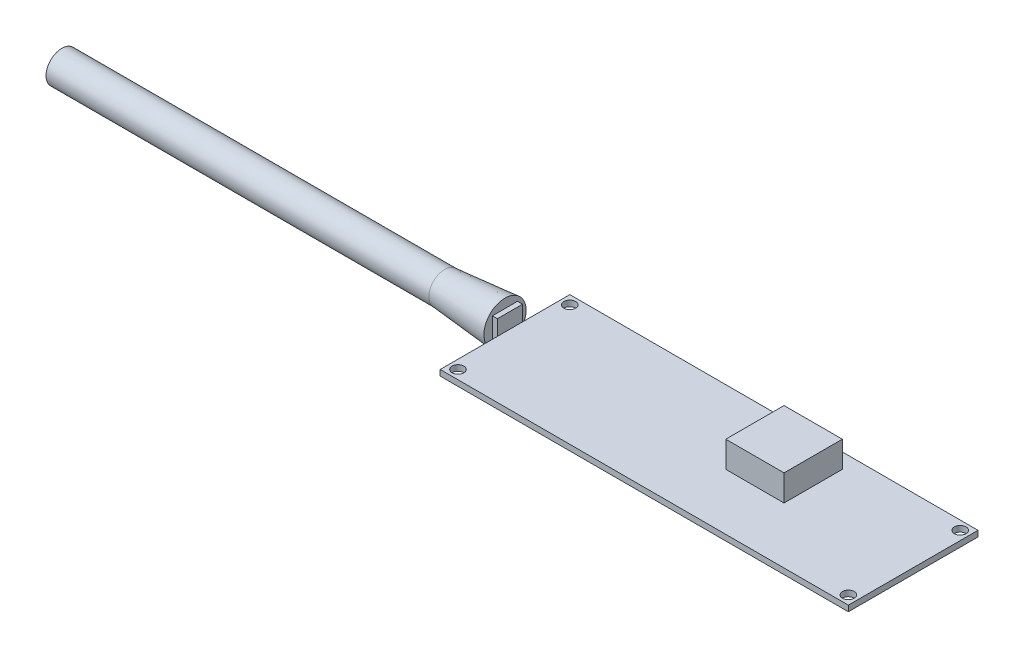
ISO-10303-21;
HEADER;
FILE_DESCRIPTION(('STEP AP214'),'2;1');
FILE_NAME('part.step','',(''),(''),'','','');
FILE_SCHEMA(('AUTOMOTIVE_DESIGN { 1 0 10303 214 1 1 1 1 }'));
ENDSEC;
DATA;
#1=APPLICATION_CONTEXT('core data for automotive mechanical design processes');
#2=APPLICATION_PROTOCOL_DEFINITION('international standard','automotive_design',2000,#1);
#3=PRODUCT_CONTEXT('',#1,'mechanical');
#4=PRODUCT('Part','Part','',(#3));
#5=PRODUCT_RELATED_PRODUCT_CATEGORY('part','',(#4));
#6=PRODUCT_DEFINITION_FORMATION('','',#4);
#7=PRODUCT_DEFINITION_CONTEXT('part definition',#1,'design');
#8=PRODUCT_DEFINITION('design','',#6,#7);
#9=PRODUCT_DEFINITION_SHAPE('','',#8);
#10=(LENGTH_UNIT() NAMED_UNIT(*) SI_UNIT(.MILLI.,.METRE.));
#11=(NAMED_UNIT(*) PLANE_ANGLE_UNIT() SI_UNIT($,.RADIAN.));
#12=(NAMED_UNIT(*) SI_UNIT($,.STERADIAN.) SOLID_ANGLE_UNIT());
#13=UNCERTAINTY_MEASURE_WITH_UNIT(LENGTH_MEASURE(1.E-05),#10,'distance_accuracy_value','');
#14=(GEOMETRIC_REPRESENTATION_CONTEXT(3) GLOBAL_UNCERTAINTY_ASSIGNED_CONTEXT((#13)) GLOBAL_UNIT_ASSIGNED_CONTEXT((#10,
#11,#12)) REPRESENTATION_CONTEXT('',''));
#15=CARTESIAN_POINT('',(0.,0.,0.));
#16=DIRECTION('',(0.,0.,1.));
#17=DIRECTION('',(1.,0.,0.));
#18=AXIS2_PLACEMENT_3D('',#15,#16,#17);
#19=CARTESIAN_POINT('',(-51.5874,1.4605,16.383));
#20=DIRECTION('',(1.,0.,0.));
#21=DIRECTION('',(0.,0.,-1.));
#22=AXIS2_PLACEMENT_3D('',#19,#20,#21);
#23=PLANE('',#22);
#24=DIRECTION('',(0.,1.,0.));
#25=VECTOR('',#24,1.);
#26=CARTESIAN_POINT('',(-51.5874,-0.762,1.905));
#27=LINE('',#26,#25);
#28=CARTESIAN_POINT('',(-51.5874,0.,1.905));
#29=VERTEX_POINT('',#28);
#30=CARTESIAN_POINT('',(-51.5874,1.4605,1.905));
#31=VERTEX_POINT('',#30);
#32=EDGE_CURVE('E11',#29,#31,#27,.T.);
#33=ORIENTED_EDGE('',*,*,#32,.F.);
#34=DIRECTION('',(0.,0.,1.));
#35=VECTOR('',#34,1.);
#36=CARTESIAN_POINT('',(-51.5874,0.,16.383));
#37=LINE('',#36,#35);
#38=CARTESIAN_POINT('',(-51.5874,0.,16.383));
#39=VERTEX_POINT('',#38);
#40=EDGE_CURVE('E260',#29,#39,#37,.T.);
#41=ORIENTED_EDGE('',*,*,#40,.T.);
#42=DIRECTION('',(0.,-1.,0.));
#43=VECTOR('',#42,1.);
#44=CARTESIAN_POINT('',(-51.5874,1.4605,16.383));
#45=LINE('',#44,#43);
#46=CARTESIAN_POINT('',(-51.5874,1.4605,16.383));
#47=VERTEX_POINT('',#46);
#48=EDGE_CURVE('E267',#47,#39,#45,.T.);
#49=ORIENTED_EDGE('',*,*,#48,.F.);
#50=DIRECTION('',(0.,0.,1.));
#51=VECTOR('',#50,1.);
#52=CARTESIAN_POINT('',(-51.5874,1.4605,16.383));
#53=LINE('',#52,#51);
#54=EDGE_CURVE('E57',#31,#47,#53,.T.);
#55=ORIENTED_EDGE('',*,*,#54,.F.);
#56=EDGE_LOOP('',(#33,#41,#49,#55));
#57=FACE_BOUND('',#56,.T.);
#58=ADVANCED_FACE('F36',(#57),#23,.F.);
#59=DIRECTION('',(0.,-1.,0.));
#60=VECTOR('',#59,1.);
#61=CARTESIAN_POINT('',(-51.5874,-0.762,-4.445));
#62=LINE('',#61,#60);
#63=CARTESIAN_POINT('',(-51.5874,1.4605,-4.445));
#64=VERTEX_POINT('',#63);
#65=CARTESIAN_POINT('',(-51.5874,0.,-4.445));
#66=VERTEX_POINT('',#65);
#67=EDGE_CURVE('E47',#64,#66,#62,.T.);
#68=ORIENTED_EDGE('',*,*,#67,.F.);
#69=CARTESIAN_POINT('',(-51.5874,1.4605,-16.383));
#70=VERTEX_POINT('',#69);
#71=EDGE_CURVE('E250',#70,#64,#53,.T.);
#72=ORIENTED_EDGE('',*,*,#71,.F.);
#73=DIRECTION('',(0.,-1.,0.));
#74=VECTOR('',#73,1.);
#75=CARTESIAN_POINT('',(-51.5874,1.4605,-16.383));
#76=LINE('',#75,#74);
#77=CARTESIAN_POINT('',(-51.5874,0.,-16.383));
#78=VERTEX_POINT('',#77);
#79=EDGE_CURVE('E270',#70,#78,#76,.T.);
#80=ORIENTED_EDGE('',*,*,#79,.T.);
#81=EDGE_CURVE('E261',#78,#66,#37,.T.);
#82=ORIENTED_EDGE('',*,*,#81,.T.);
#83=EDGE_LOOP('',(#68,#72,#80,#82));
#84=FACE_BOUND('',#83,.T.);
#85=ADVANCED_FACE('F340',(#84),#23,.F.);
#86=CARTESIAN_POINT('',(0.,1.4605,0.));
#87=DIRECTION('',(0.,-1.,0.));
#88=DIRECTION('',(0.,0.,-1.));
#89=AXIS2_PLACEMENT_3D('',#86,#87,#88);
#90=PLANE('',#89);
#91=DIRECTION('',(0.,0.,-1.));
#92=VECTOR('',#91,1.);
#93=CARTESIAN_POINT('',(51.5874,1.4605,16.383));
#94=LINE('',#93,#92);
#95=CARTESIAN_POINT('',(51.5874,1.4605,16.383));
#96=VERTEX_POINT('',#95);
#97=CARTESIAN_POINT('',(51.5874,1.4605,-16.383));
#98=VERTEX_POINT('',#97);
#99=EDGE_CURVE('E244',#96,#98,#94,.T.);
#100=ORIENTED_EDGE('',*,*,#99,.T.);
#101=DIRECTION('',(-1.,0.,0.));
#102=VECTOR('',#101,1.);
#103=CARTESIAN_POINT('',(-51.5874,1.4605,-16.383));
#104=LINE('',#103,#102);
#105=EDGE_CURVE('E247',#98,#70,#104,.T.);
#106=ORIENTED_EDGE('',*,*,#105,.T.);
#107=ORIENTED_EDGE('',*,*,#71,.T.);
#108=EDGE_CURVE('E253',#64,#31,#53,.T.);
#109=ORIENTED_EDGE('',*,*,#108,.T.);
#110=ORIENTED_EDGE('',*,*,#54,.T.);
#111=DIRECTION('',(1.,0.,0.));
#112=VECTOR('',#111,1.);
#113=CARTESIAN_POINT('',(-51.5874,1.4605,16.383));
#114=LINE('',#113,#112);
#115=EDGE_CURVE('E252',#47,#96,#114,.T.);
#116=ORIENTED_EDGE('',*,*,#115,.T.);
#117=EDGE_LOOP('',(#100,#106,#107,#109,#110,#116));
#118=FACE_BOUND('',#117,.T.);
#119=CARTESIAN_POINT('',(-49.3395,1.4605,-14.1351));
#120=DIRECTION('',(0.,1.,0.));
#121=DIRECTION('',(0.,0.,1.));
#122=AXIS2_PLACEMENT_3D('',#119,#120,#121);
#123=CIRCLE('',#122,1.4859);
#124=CARTESIAN_POINT('',(-49.3395,1.4605,-12.6492));
#125=VERTEX_POINT('',#124);
#126=EDGE_CURVE('E227',#125,#125,#123,.T.);
#127=ORIENTED_EDGE('',*,*,#126,.F.);
#128=EDGE_LOOP('',(#127));
#129=FACE_BOUND('',#128,.T.);
#130=CARTESIAN_POINT('',(49.3395,1.4605,-14.1351));
#131=DIRECTION('',(0.,1.,0.));
#132=DIRECTION('',(0.,0.,1.));
#133=AXIS2_PLACEMENT_3D('',#130,#131,#132);
#134=CIRCLE('',#133,1.4859);
#135=CARTESIAN_POINT('',(49.3395,1.4605,-12.6492));
#136=VERTEX_POINT('',#135);
#137=EDGE_CURVE('E220',#136,#136,#134,.T.);
#138=ORIENTED_EDGE('',*,*,#137,.F.);
#139=EDGE_LOOP('',(#138));
#140=FACE_BOUND('',#139,.T.);
#141=CARTESIAN_POINT('',(49.3395,1.4605,14.1351));
#142=DIRECTION('',(0.,1.,0.));
#143=DIRECTION('',(0.,0.,1.));
#144=AXIS2_PLACEMENT_3D('',#141,#142,#143);
#145=CIRCLE('',#144,1.4859);
#146=CARTESIAN_POINT('',(49.3395,1.4605,15.621));
#147=VERTEX_POINT('',#146);
#148=EDGE_CURVE('E228',#147,#147,#145,.T.);
#149=ORIENTED_EDGE('',*,*,#148,.F.);
#150=EDGE_LOOP('',(#149));
#151=FACE_BOUND('',#150,.T.);
#152=CARTESIAN_POINT('',(-49.3395,1.4605,14.1351));
#153=DIRECTION('',(0.,1.,0.));
#154=DIRECTION('',(0.,0.,1.));
#155=AXIS2_PLACEMENT_3D('',#152,#153,#154);
#156=CIRCLE('',#155,1.4859);
#157=CARTESIAN_POINT('',(-49.3395,1.4605,15.621));
#158=VERTEX_POINT('',#157);
#159=EDGE_CURVE('E219',#158,#158,#156,.T.);
#160=ORIENTED_EDGE('',*,*,#159,.F.);
#161=EDGE_LOOP('',(#160));
#162=FACE_BOUND('',#161,.T.);
#163=DIRECTION('',(0.,0.,-1.));
#164=VECTOR('',#163,1.);
#165=CARTESIAN_POINT('',(21.1074,1.4605,-12.573));
#166=LINE('',#165,#164);
#167=CARTESIAN_POINT('',(21.1074,1.4605,2.159));
#168=VERTEX_POINT('',#167);
#169=CARTESIAN_POINT('',(21.1074,1.4605,-12.573));
#170=VERTEX_POINT('',#169);
#171=EDGE_CURVE('E186',#168,#170,#166,.T.);
#172=ORIENTED_EDGE('',*,*,#171,.F.);
#173=DIRECTION('',(1.,0.,0.));
#174=VECTOR('',#173,1.);
#175=CARTESIAN_POINT('',(6.37540000000003,1.4605,2.159));
#176=LINE('',#175,#174);
#177=CARTESIAN_POINT('',(6.37540000000003,1.4605,2.159));
#178=VERTEX_POINT('',#177);
#179=EDGE_CURVE('E191',#178,#168,#176,.T.);
#180=ORIENTED_EDGE('',*,*,#179,.F.);
#181=DIRECTION('',(0.,0.,1.));
#182=VECTOR('',#181,1.);
#183=CARTESIAN_POINT('',(6.37540000000002,1.4605,-12.573));
#184=LINE('',#183,#182);
#185=CARTESIAN_POINT('',(6.37540000000002,1.4605,-12.573));
#186=VERTEX_POINT('',#185);
#187=EDGE_CURVE('E203',#186,#178,#184,.T.);
#188=ORIENTED_EDGE('',*,*,#187,.F.);
#189=DIRECTION('',(-1.,0.,0.));
#190=VECTOR('',#189,1.);
#191=CARTESIAN_POINT('',(6.37540000000002,1.4605,-12.573));
#192=LINE('',#191,#190);
#193=EDGE_CURVE('E200',#170,#186,#192,.T.);
#194=ORIENTED_EDGE('',*,*,#193,.F.);
#195=EDGE_LOOP('',(#172,#180,#188,#194));
#196=FACE_BOUND('',#195,.T.);
#197=ADVANCED_FACE('F320',(#118,#129,#140,#151,#162,#196),#90,.F.);
#198=CARTESIAN_POINT('',(51.5874,1.4605,16.383));
#199=DIRECTION('',(-1.,0.,0.));
#200=DIRECTION('',(0.,0.,1.));
#201=AXIS2_PLACEMENT_3D('',#198,#199,#200);
#202=PLANE('',#201);
#203=DIRECTION('',(0.,0.,-1.));
#204=VECTOR('',#203,1.);
#205=CARTESIAN_POINT('',(51.5874,0.,16.383));
#206=LINE('',#205,#204);
#207=CARTESIAN_POINT('',(51.5874,0.,16.383));
#208=VERTEX_POINT('',#207);
#209=CARTESIAN_POINT('',(51.5874,0.,-16.383));
#210=VERTEX_POINT('',#209);
#211=EDGE_CURVE('E243',#208,#210,#206,.T.);
#212=ORIENTED_EDGE('',*,*,#211,.T.);
#213=DIRECTION('',(0.,-1.,0.));
#214=VECTOR('',#213,1.);
#215=CARTESIAN_POINT('',(51.5874,1.4605,-16.383));
#216=LINE('',#215,#214);
#217=EDGE_CURVE('E273',#98,#210,#216,.T.);
#218=ORIENTED_EDGE('',*,*,#217,.F.);
#219=ORIENTED_EDGE('',*,*,#99,.F.);
#220=DIRECTION('',(0.,-1.,0.));
#221=VECTOR('',#220,1.);
#222=CARTESIAN_POINT('',(51.5874,1.4605,16.383));
#223=LINE('',#222,#221);
#224=EDGE_CURVE('E255',#96,#208,#223,.T.);
#225=ORIENTED_EDGE('',*,*,#224,.T.);
#226=EDGE_LOOP('',(#212,#218,#219,#225));
#227=FACE_BOUND('',#226,.T.);
#228=ADVANCED_FACE('F38',(#227),#202,.F.);
#229=CARTESIAN_POINT('',(-51.5874,1.4605,-16.383));
#230=DIRECTION('',(0.,0.,1.));
#231=DIRECTION('',(1.,0.,0.));
#232=AXIS2_PLACEMENT_3D('',#229,#230,#231);
#233=PLANE('',#232);
#234=DIRECTION('',(-1.,0.,0.));
#235=VECTOR('',#234,1.);
#236=CARTESIAN_POINT('',(-51.5874,0.,-16.383));
#237=LINE('',#236,#235);
#238=EDGE_CURVE('E258',#210,#78,#237,.T.);
#239=ORIENTED_EDGE('',*,*,#238,.T.);
#240=ORIENTED_EDGE('',*,*,#79,.F.);
#241=ORIENTED_EDGE('',*,*,#105,.F.);
#242=ORIENTED_EDGE('',*,*,#217,.T.);
#243=EDGE_LOOP('',(#239,#240,#241,#242));
#244=FACE_BOUND('',#243,.T.);
#245=ADVANCED_FACE('F347',(#244),#233,.F.);
#246=CARTESIAN_POINT('',(-51.5874,1.4605,16.383));
#247=DIRECTION('',(0.,0.,-1.));
#248=DIRECTION('',(-1.,0.,0.));
#249=AXIS2_PLACEMENT_3D('',#246,#247,#248);
#250=PLANE('',#249);
#251=DIRECTION('',(1.,0.,0.));
#252=VECTOR('',#251,1.);
#253=CARTESIAN_POINT('',(-51.5874,0.,16.383));
#254=LINE('',#253,#252);
#255=EDGE_CURVE('E248',#39,#208,#254,.T.);
#256=ORIENTED_EDGE('',*,*,#255,.T.);
#257=ORIENTED_EDGE('',*,*,#224,.F.);
#258=ORIENTED_EDGE('',*,*,#115,.F.);
#259=ORIENTED_EDGE('',*,*,#48,.T.);
#260=EDGE_LOOP('',(#256,#257,#258,#259));
#261=FACE_BOUND('',#260,.T.);
#262=ADVANCED_FACE('F314',(#261),#250,.F.);
#263=CARTESIAN_POINT('',(0.,0.,0.));
#264=DIRECTION('',(0.,-1.,0.));
#265=DIRECTION('',(0.,0.,-1.));
#266=AXIS2_PLACEMENT_3D('',#263,#264,#265);
#267=PLANE('',#266);
#268=CARTESIAN_POINT('',(-49.3395,0.,14.1351));
#269=DIRECTION('',(0.,-1.,0.));
#270=DIRECTION('',(0.,0.,-1.));
#271=AXIS2_PLACEMENT_3D('',#268,#269,#270);
#272=CIRCLE('',#271,1.4859);
#273=CARTESIAN_POINT('',(-49.3395,0.,12.6492));
#274=VERTEX_POINT('',#273);
#275=EDGE_CURVE('E231',#274,#274,#272,.F.);
#276=ORIENTED_EDGE('',*,*,#275,.T.);
#277=EDGE_LOOP('',(#276));
#278=FACE_BOUND('',#277,.T.);
#279=CARTESIAN_POINT('',(49.3395,0.,14.1351));
#280=DIRECTION('',(0.,-1.,0.));
#281=DIRECTION('',(0.,0.,-1.));
#282=AXIS2_PLACEMENT_3D('',#279,#280,#281);
#283=CIRCLE('',#282,1.4859);
#284=CARTESIAN_POINT('',(49.3395,0.,12.6492));
#285=VERTEX_POINT('',#284);
#286=EDGE_CURVE('E224',#285,#285,#283,.F.);
#287=ORIENTED_EDGE('',*,*,#286,.T.);
#288=EDGE_LOOP('',(#287));
#289=FACE_BOUND('',#288,.T.);
#290=CARTESIAN_POINT('',(49.3395,0.,-14.1351));
#291=DIRECTION('',(0.,-1.,0.));
#292=DIRECTION('',(0.,0.,-1.));
#293=AXIS2_PLACEMENT_3D('',#290,#291,#292);
#294=CIRCLE('',#293,1.4859);
#295=CARTESIAN_POINT('',(49.3395,0.,-15.621));
#296=VERTEX_POINT('',#295);
#297=EDGE_CURVE('E223',#296,#296,#294,.F.);
#298=ORIENTED_EDGE('',*,*,#297,.T.);
#299=EDGE_LOOP('',(#298));
#300=FACE_BOUND('',#299,.T.);
#301=CARTESIAN_POINT('',(-49.3395,0.,-14.1351));
#302=DIRECTION('',(0.,-1.,0.));
#303=DIRECTION('',(0.,0.,-1.));
#304=AXIS2_PLACEMENT_3D('',#301,#302,#303);
#305=CIRCLE('',#304,1.4859);
#306=CARTESIAN_POINT('',(-49.3395,0.,-15.621));
#307=VERTEX_POINT('',#306);
#308=EDGE_CURVE('E240',#307,#307,#305,.F.);
#309=ORIENTED_EDGE('',*,*,#308,.T.);
#310=EDGE_LOOP('',(#309));
#311=FACE_BOUND('',#310,.T.);
#312=ORIENTED_EDGE('',*,*,#211,.F.);
#313=ORIENTED_EDGE('',*,*,#255,.F.);
#314=ORIENTED_EDGE('',*,*,#40,.F.);
#315=EDGE_CURVE('E263',#66,#29,#37,.T.);
#316=ORIENTED_EDGE('',*,*,#315,.F.);
#317=ORIENTED_EDGE('',*,*,#81,.F.);
#318=ORIENTED_EDGE('',*,*,#238,.F.);
#319=EDGE_LOOP('',(#312,#313,#314,#316,#317,#318));
#320=FACE_BOUND('',#319,.T.);
#321=ADVANCED_FACE('F310',(#278,#289,#300,#311,#320),#267,.T.);
#322=CARTESIAN_POINT('',(-49.3395,-4.20275986466036,-14.1351));
#323=DIRECTION('',(0.,1.,0.));
#324=DIRECTION('',(0.,0.,1.));
#325=AXIS2_PLACEMENT_3D('',#322,#323,#324);
#326=CYLINDRICAL_SURFACE('',#325,1.4859);
#327=ORIENTED_EDGE('',*,*,#126,.T.);
#328=EDGE_LOOP('',(#327));
#329=FACE_BOUND('',#328,.T.);
#330=ORIENTED_EDGE('',*,*,#308,.F.);
#331=EDGE_LOOP('',(#330));
#332=FACE_BOUND('',#331,.T.);
#333=ADVANCED_FACE('F361',(#329,#332),#326,.F.);
#334=CARTESIAN_POINT('',(49.3395,-4.20275986466036,-14.1351));
#335=DIRECTION('',(0.,1.,0.));
#336=DIRECTION('',(0.,0.,1.));
#337=AXIS2_PLACEMENT_3D('',#334,#335,#336);
#338=CYLINDRICAL_SURFACE('',#337,1.4859);
#339=ORIENTED_EDGE('',*,*,#137,.T.);
#340=EDGE_LOOP('',(#339));
#341=FACE_BOUND('',#340,.T.);
#342=ORIENTED_EDGE('',*,*,#297,.F.);
#343=EDGE_LOOP('',(#342));
#344=FACE_BOUND('',#343,.T.);
#345=ADVANCED_FACE('F368',(#341,#344),#338,.F.);
#346=CARTESIAN_POINT('',(49.3395,-4.20275986466036,14.1351));
#347=DIRECTION('',(0.,1.,0.));
#348=DIRECTION('',(0.,0.,1.));
#349=AXIS2_PLACEMENT_3D('',#346,#347,#348);
#350=CYLINDRICAL_SURFACE('',#349,1.4859);
#351=ORIENTED_EDGE('',*,*,#148,.T.);
#352=EDGE_LOOP('',(#351));
#353=FACE_BOUND('',#352,.T.);
#354=ORIENTED_EDGE('',*,*,#286,.F.);
#355=EDGE_LOOP('',(#354));
#356=FACE_BOUND('',#355,.T.);
#357=ADVANCED_FACE('F380',(#353,#356),#350,.F.);
#358=CARTESIAN_POINT('',(-49.3395,-4.20275986466036,14.1351));
#359=DIRECTION('',(0.,1.,0.));
#360=DIRECTION('',(0.,0.,1.));
#361=AXIS2_PLACEMENT_3D('',#358,#359,#360);
#362=CYLINDRICAL_SURFACE('',#361,1.4859);
#363=ORIENTED_EDGE('',*,*,#159,.T.);
#364=EDGE_LOOP('',(#363));
#365=FACE_BOUND('',#364,.T.);
#366=ORIENTED_EDGE('',*,*,#275,.F.);
#367=EDGE_LOOP('',(#366));
#368=FACE_BOUND('',#367,.T.);
#369=ADVANCED_FACE('F386',(#365,#368),#362,.F.);
#370=CARTESIAN_POINT('',(21.1074,8.0645,-12.573));
#371=DIRECTION('',(-1.,0.,0.));
#372=DIRECTION('',(0.,0.,1.));
#373=AXIS2_PLACEMENT_3D('',#370,#371,#372);
#374=PLANE('',#373);
#375=ORIENTED_EDGE('',*,*,#171,.T.);
#376=DIRECTION('',(0.,-1.,0.));
#377=VECTOR('',#376,1.);
#378=CARTESIAN_POINT('',(21.1074,8.0645,-12.573));
#379=LINE('',#378,#377);
#380=CARTESIAN_POINT('',(21.1074,8.0645,-12.573));
#381=VERTEX_POINT('',#380);
#382=EDGE_CURVE('E216',#381,#170,#379,.T.);
#383=ORIENTED_EDGE('',*,*,#382,.F.);
#384=DIRECTION('',(0.,0.,-1.));
#385=VECTOR('',#384,1.);
#386=CARTESIAN_POINT('',(21.1074,8.0645,-12.573));
#387=LINE('',#386,#385);
#388=CARTESIAN_POINT('',(21.1074,8.0645,2.159));
#389=VERTEX_POINT('',#388);
#390=EDGE_CURVE('E187',#389,#381,#387,.T.);
#391=ORIENTED_EDGE('',*,*,#390,.F.);
#392=DIRECTION('',(0.,-1.,0.));
#393=VECTOR('',#392,1.);
#394=CARTESIAN_POINT('',(21.1074,8.0645,2.159));
#395=LINE('',#394,#393);
#396=EDGE_CURVE('E197',#389,#168,#395,.T.);
#397=ORIENTED_EDGE('',*,*,#396,.T.);
#398=EDGE_LOOP('',(#375,#383,#391,#397));
#399=FACE_BOUND('',#398,.T.);
#400=ADVANCED_FACE('F390',(#399),#374,.F.);
#401=CARTESIAN_POINT('',(6.37540000000002,8.0645,-12.573));
#402=DIRECTION('',(0.,0.,1.));
#403=DIRECTION('',(1.,0.,0.));
#404=AXIS2_PLACEMENT_3D('',#401,#402,#403);
#405=PLANE('',#404);
#406=ORIENTED_EDGE('',*,*,#193,.T.);
#407=DIRECTION('',(0.,-1.,0.));
#408=VECTOR('',#407,1.);
#409=CARTESIAN_POINT('',(6.37540000000002,8.0645,-12.573));
#410=LINE('',#409,#408);
#411=CARTESIAN_POINT('',(6.37540000000002,8.0645,-12.573));
#412=VERTEX_POINT('',#411);
#413=EDGE_CURVE('E213',#412,#186,#410,.T.);
#414=ORIENTED_EDGE('',*,*,#413,.F.);
#415=DIRECTION('',(-1.,0.,0.));
#416=VECTOR('',#415,1.);
#417=CARTESIAN_POINT('',(6.37540000000002,8.0645,-12.573));
#418=LINE('',#417,#416);
#419=EDGE_CURVE('E190',#381,#412,#418,.T.);
#420=ORIENTED_EDGE('',*,*,#419,.F.);
#421=ORIENTED_EDGE('',*,*,#382,.T.);
#422=EDGE_LOOP('',(#406,#414,#420,#421));
#423=FACE_BOUND('',#422,.T.);
#424=ADVANCED_FACE('F397',(#423),#405,.F.);
#425=CARTESIAN_POINT('',(6.37540000000002,8.0645,-12.573));
#426=DIRECTION('',(1.,0.,0.));
#427=DIRECTION('',(0.,0.,-1.));
#428=AXIS2_PLACEMENT_3D('',#425,#426,#427);
#429=PLANE('',#428);
#430=ORIENTED_EDGE('',*,*,#187,.T.);
#431=DIRECTION('',(0.,-1.,0.));
#432=VECTOR('',#431,1.);
#433=CARTESIAN_POINT('',(6.37540000000003,8.0645,2.159));
#434=LINE('',#433,#432);
#435=CARTESIAN_POINT('',(6.37540000000003,8.0645,2.159));
#436=VERTEX_POINT('',#435);
#437=EDGE_CURVE('E210',#436,#178,#434,.T.);
#438=ORIENTED_EDGE('',*,*,#437,.F.);
#439=DIRECTION('',(0.,0.,1.));
#440=VECTOR('',#439,1.);
#441=CARTESIAN_POINT('',(6.37540000000002,8.0645,-12.573));
#442=LINE('',#441,#440);
#443=EDGE_CURVE('E193',#412,#436,#442,.T.);
#444=ORIENTED_EDGE('',*,*,#443,.F.);
#445=ORIENTED_EDGE('',*,*,#413,.T.);
#446=EDGE_LOOP('',(#430,#438,#444,#445));
#447=FACE_BOUND('',#446,.T.);
#448=ADVANCED_FACE('F412',(#447),#429,.F.);
#449=CARTESIAN_POINT('',(6.37540000000003,8.0645,2.159));
#450=DIRECTION('',(0.,0.,-1.));
#451=DIRECTION('',(-1.,0.,0.));
#452=AXIS2_PLACEMENT_3D('',#449,#450,#451);
#453=PLANE('',#452);
#454=ORIENTED_EDGE('',*,*,#179,.T.);
#455=ORIENTED_EDGE('',*,*,#396,.F.);
#456=DIRECTION('',(1.,0.,0.));
#457=VECTOR('',#456,1.);
#458=CARTESIAN_POINT('',(6.37540000000003,8.0645,2.159));
#459=LINE('',#458,#457);
#460=EDGE_CURVE('E195',#436,#389,#459,.T.);
#461=ORIENTED_EDGE('',*,*,#460,.F.);
#462=ORIENTED_EDGE('',*,*,#437,.T.);
#463=EDGE_LOOP('',(#454,#455,#461,#462));
#464=FACE_BOUND('',#463,.T.);
#465=ADVANCED_FACE('F334',(#464),#453,.F.);
#466=CARTESIAN_POINT('',(0.,8.0645,0.));
#467=DIRECTION('',(0.,1.,0.));
#468=DIRECTION('',(0.,0.,1.));
#469=AXIS2_PLACEMENT_3D('',#466,#467,#468);
#470=PLANE('',#469);
#471=ORIENTED_EDGE('',*,*,#390,.T.);
#472=ORIENTED_EDGE('',*,*,#419,.T.);
#473=ORIENTED_EDGE('',*,*,#443,.T.);
#474=ORIENTED_EDGE('',*,*,#460,.T.);
#475=EDGE_LOOP('',(#471,#472,#473,#474));
#476=FACE_BOUND('',#475,.T.);
#477=ADVANCED_FACE('F327',(#476),#470,.T.);
#478=CARTESIAN_POINT('',(-51.5874,0.,0.));
#479=DIRECTION('',(1.,0.,0.));
#480=DIRECTION('',(0.,0.,-1.));
#481=AXIS2_PLACEMENT_3D('',#478,#479,#480);
#482=PLANE('',#481);
#483=ORIENTED_EDGE('',*,*,#108,.F.);
#484=CARTESIAN_POINT('',(-51.5874,5.334,-4.445));
#485=VERTEX_POINT('',#484);
#486=EDGE_CURVE('E177',#485,#64,#62,.T.);
#487=ORIENTED_EDGE('',*,*,#486,.F.);
#488=DIRECTION('',(0.,0.,-1.));
#489=VECTOR('',#488,1.);
#490=CARTESIAN_POINT('',(-51.5874,5.334,-4.445));
#491=LINE('',#490,#489);
#492=CARTESIAN_POINT('',(-51.5874,5.334,1.905));
#493=VERTEX_POINT('',#492);
#494=EDGE_CURVE('E174',#493,#485,#491,.T.);
#495=ORIENTED_EDGE('',*,*,#494,.F.);
#496=EDGE_CURVE('E50',#31,#493,#27,.T.);
#497=ORIENTED_EDGE('',*,*,#496,.F.);
#498=EDGE_LOOP('',(#483,#487,#495,#497));
#499=FACE_BOUND('',#498,.T.);
#500=ADVANCED_FACE('F325',(#499),#482,.T.);
#501=CARTESIAN_POINT('',(-52.8574,-0.762,1.905));
#502=DIRECTION('',(0.,0.,-1.));
#503=DIRECTION('',(-1.,0.,0.));
#504=AXIS2_PLACEMENT_3D('',#501,#502,#503);
#505=PLANE('',#504);
#506=CARTESIAN_POINT('',(-51.5874,-0.762,1.905));
#507=VERTEX_POINT('',#506);
#508=EDGE_CURVE('E49',#507,#29,#27,.T.);
#509=ORIENTED_EDGE('',*,*,#508,.T.);
#510=ORIENTED_EDGE('',*,*,#32,.T.);
#511=ORIENTED_EDGE('',*,*,#496,.T.);
#512=DIRECTION('',(1.,0.,0.));
#513=VECTOR('',#512,1.);
#514=CARTESIAN_POINT('',(-52.8574,5.334,1.905));
#515=LINE('',#514,#513);
#516=CARTESIAN_POINT('',(-52.8574,5.334,1.905));
#517=VERTEX_POINT('',#516);
#518=EDGE_CURVE('E151',#517,#493,#515,.T.);
#519=ORIENTED_EDGE('',*,*,#518,.F.);
#520=DIRECTION('',(0.,1.,0.));
#521=VECTOR('',#520,1.);
#522=CARTESIAN_POINT('',(-52.8574,-0.762,1.905));
#523=LINE('',#522,#521);
#524=CARTESIAN_POINT('',(-52.8574,-0.762,1.905));
#525=VERTEX_POINT('',#524);
#526=EDGE_CURVE('E144',#525,#517,#523,.T.);
#527=ORIENTED_EDGE('',*,*,#526,.F.);
#528=DIRECTION('',(1.,0.,0.));
#529=VECTOR('',#528,1.);
#530=CARTESIAN_POINT('',(-52.8574,-0.762,1.905));
#531=LINE('',#530,#529);
#532=EDGE_CURVE('E148',#525,#507,#531,.T.);
#533=ORIENTED_EDGE('',*,*,#532,.T.);
#534=EDGE_LOOP('',(#509,#510,#511,#519,#527,#533));
#535=FACE_BOUND('',#534,.T.);
#536=ADVANCED_FACE('F147',(#535),#505,.F.);
#537=CARTESIAN_POINT('',(-52.8574,5.334,-4.445));
#538=DIRECTION('',(0.,-1.,0.));
#539=DIRECTION('',(0.,0.,-1.));
#540=AXIS2_PLACEMENT_3D('',#537,#538,#539);
#541=PLANE('',#540);
#542=ORIENTED_EDGE('',*,*,#494,.T.);
#543=DIRECTION('',(1.,0.,0.));
#544=VECTOR('',#543,1.);
#545=CARTESIAN_POINT('',(-52.8574,5.334,-4.445));
#546=LINE('',#545,#544);
#547=CARTESIAN_POINT('',(-52.8574,5.334,-4.445));
#548=VERTEX_POINT('',#547);
#549=EDGE_CURVE('E182',#548,#485,#546,.T.);
#550=ORIENTED_EDGE('',*,*,#549,.F.);
#551=DIRECTION('',(0.,0.,-1.));
#552=VECTOR('',#551,1.);
#553=CARTESIAN_POINT('',(-52.8574,5.334,-4.445));
#554=LINE('',#553,#552);
#555=EDGE_CURVE('E155',#517,#548,#554,.T.);
#556=ORIENTED_EDGE('',*,*,#555,.F.);
#557=ORIENTED_EDGE('',*,*,#518,.T.);
#558=EDGE_LOOP('',(#542,#550,#556,#557));
#559=FACE_BOUND('',#558,.T.);
#560=ADVANCED_FACE('F295',(#559),#541,.F.);
#561=CARTESIAN_POINT('',(-52.8574,-0.762,-4.445));
#562=DIRECTION('',(0.,0.,1.));
#563=DIRECTION('',(1.,0.,0.));
#564=AXIS2_PLACEMENT_3D('',#561,#562,#563);
#565=PLANE('',#564);
#566=ORIENTED_EDGE('',*,*,#486,.T.);
#567=ORIENTED_EDGE('',*,*,#67,.T.);
#568=CARTESIAN_POINT('',(-51.5874,-0.762,-4.445));
#569=VERTEX_POINT('',#568);
#570=EDGE_CURVE('E176',#66,#569,#62,.T.);
#571=ORIENTED_EDGE('',*,*,#570,.T.);
#572=DIRECTION('',(1.,0.,0.));
#573=VECTOR('',#572,1.);
#574=CARTESIAN_POINT('',(-52.8574,-0.762,-4.445));
#575=LINE('',#574,#573);
#576=CARTESIAN_POINT('',(-52.8574,-0.762,-4.445));
#577=VERTEX_POINT('',#576);
#578=EDGE_CURVE('E165',#577,#569,#575,.T.);
#579=ORIENTED_EDGE('',*,*,#578,.F.);
#580=DIRECTION('',(0.,-1.,0.));
#581=VECTOR('',#580,1.);
#582=CARTESIAN_POINT('',(-52.8574,-0.762,-4.445));
#583=LINE('',#582,#581);
#584=EDGE_CURVE('E169',#548,#577,#583,.T.);
#585=ORIENTED_EDGE('',*,*,#584,.F.);
#586=ORIENTED_EDGE('',*,*,#549,.T.);
#587=EDGE_LOOP('',(#566,#567,#571,#579,#585,#586));
#588=FACE_BOUND('',#587,.T.);
#589=ADVANCED_FACE('F299',(#588),#565,.F.);
#590=CARTESIAN_POINT('',(-52.8574,-0.762,-4.445));
#591=DIRECTION('',(0.,1.,0.));
#592=DIRECTION('',(0.,0.,1.));
#593=AXIS2_PLACEMENT_3D('',#590,#591,#592);
#594=PLANE('',#593);
#595=DIRECTION('',(0.,0.,1.));
#596=VECTOR('',#595,1.);
#597=CARTESIAN_POINT('',(-51.5874,-0.762,-4.445));
#598=LINE('',#597,#596);
#599=EDGE_CURVE('E156',#569,#507,#598,.T.);
#600=ORIENTED_EDGE('',*,*,#599,.T.);
#601=ORIENTED_EDGE('',*,*,#532,.F.);
#602=DIRECTION('',(0.,0.,1.));
#603=VECTOR('',#602,1.);
#604=CARTESIAN_POINT('',(-52.8574,-0.762,-4.445));
#605=LINE('',#604,#603);
#606=EDGE_CURVE('E162',#577,#525,#605,.T.);
#607=ORIENTED_EDGE('',*,*,#606,.F.);
#608=ORIENTED_EDGE('',*,*,#578,.T.);
#609=EDGE_LOOP('',(#600,#601,#607,#608));
#610=FACE_BOUND('',#609,.T.);
#611=ADVANCED_FACE('F160',(#610),#594,.F.);
#612=ORIENTED_EDGE('',*,*,#570,.F.);
#613=ORIENTED_EDGE('',*,*,#315,.T.);
#614=ORIENTED_EDGE('',*,*,#508,.F.);
#615=ORIENTED_EDGE('',*,*,#599,.F.);
#616=EDGE_LOOP('',(#612,#613,#614,#615));
#617=FACE_BOUND('',#616,.T.);
#618=ADVANCED_FACE('F302',(#617),#482,.T.);
#619=CARTESIAN_POINT('',(-52.8574,2.286,-1.27));
#620=DIRECTION('',(-1.,0.,0.));
#621=DIRECTION('',(0.,0.,1.));
#622=AXIS2_PLACEMENT_3D('',#619,#620,#621);
#623=PLANE('',#622);
#624=CARTESIAN_POINT('',(-52.8574,2.286,-1.27));
#625=DIRECTION('',(-1.,0.,0.));
#626=DIRECTION('',(0.,0.,1.));
#627=AXIS2_PLACEMENT_3D('',#624,#625,#626);
#628=CIRCLE('',#627,5.334);
#629=CARTESIAN_POINT('',(-52.8574,2.286,4.064));
#630=VERTEX_POINT('',#629);
#631=EDGE_CURVE('E283',#630,#630,#628,.T.);
#632=ORIENTED_EDGE('',*,*,#631,.F.);
#633=EDGE_LOOP('',(#632));
#634=FACE_BOUND('',#633,.T.);
#635=ORIENTED_EDGE('',*,*,#606,.T.);
#636=ORIENTED_EDGE('',*,*,#526,.T.);
#637=ORIENTED_EDGE('',*,*,#555,.T.);
#638=ORIENTED_EDGE('',*,*,#584,.T.);
#639=EDGE_LOOP('',(#635,#636,#637,#638));
#640=FACE_BOUND('',#639,.T.);
#641=ADVANCED_FACE('F167',(#634,#640),#623,.F.);
#642=CARTESIAN_POINT('',(-52.8574,2.286,-1.27));
#643=DIRECTION('',(1.,0.,0.));
#644=DIRECTION('',(0.,0.,1.));
#645=AXIS2_PLACEMENT_3D('',#642,#643,#644);
#646=CONICAL_SURFACE('',#645,5.334,0.0872664625997165);
#647=CARTESIAN_POINT('',(-68.0974,2.286,-1.27));
#648=DIRECTION('',(-1.,0.,0.));
#649=DIRECTION('',(0.,0.,1.));
#650=AXIS2_PLACEMENT_3D('',#647,#648,#649);
#651=CIRCLE('',#650,4.0005);
#652=CARTESIAN_POINT('',(-68.0974,2.286,2.7305));
#653=VERTEX_POINT('',#652);
#654=EDGE_CURVE('E278',#653,#653,#651,.T.);
#655=ORIENTED_EDGE('',*,*,#654,.F.);
#656=EDGE_LOOP('',(#655));
#657=FACE_BOUND('',#656,.T.);
#658=ORIENTED_EDGE('',*,*,#631,.T.);
#659=EDGE_LOOP('',(#658));
#660=FACE_BOUND('',#659,.T.);
#661=ADVANCED_FACE('F279',(#657,#660),#646,.T.);
#662=CARTESIAN_POINT('',(-164.8714,2.286,-1.27));
#663=DIRECTION('',(1.,0.,0.));
#664=DIRECTION('',(0.,0.,-1.));
#665=AXIS2_PLACEMENT_3D('',#662,#663,#664);
#666=CYLINDRICAL_SURFACE('',#665,4.0005);
#667=CARTESIAN_POINT('',(-164.8714,2.286,-1.27));
#668=DIRECTION('',(-1.,0.,0.));
#669=DIRECTION('',(0.,0.,1.));
#670=AXIS2_PLACEMENT_3D('',#667,#668,#669);
#671=CIRCLE('',#670,4.0005);
#672=CARTESIAN_POINT('',(-164.8714,2.286,2.7305));
#673=VERTEX_POINT('',#672);
#674=EDGE_CURVE('E285',#673,#673,#671,.T.);
#675=ORIENTED_EDGE('',*,*,#674,.F.);
#676=EDGE_LOOP('',(#675));
#677=FACE_BOUND('',#676,.T.);
#678=ORIENTED_EDGE('',*,*,#654,.T.);
#679=EDGE_LOOP('',(#678));
#680=FACE_BOUND('',#679,.T.);
#681=ADVANCED_FACE('F448',(#677,#680),#666,.T.);
#682=CARTESIAN_POINT('',(-164.8714,2.286,-1.27));
#683=DIRECTION('',(-1.,0.,0.));
#684=DIRECTION('',(0.,0.,1.));
#685=AXIS2_PLACEMENT_3D('',#682,#683,#684);
#686=PLANE('',#685);
#687=ORIENTED_EDGE('',*,*,#674,.T.);
#688=EDGE_LOOP('',(#687));
#689=FACE_BOUND('',#688,.T.);
#690=ADVANCED_FACE('F454',(#689),#686,.T.);
#691=CLOSED_SHELL('',(#58,#85,#197,#228,#245,#262,#321,#333,#345,#357,#369,#400,#424,#448,#465,
#477,#500,#536,#560,#589,#611,#618,#641,#661,#681,#690));
#692=MANIFOLD_SOLID_BREP('B2',#691);
#693=ADVANCED_BREP_SHAPE_REPRESENTATION('',(#18,#692),#14);
#694=SHAPE_DEFINITION_REPRESENTATION(#9,#693);
ENDSEC;
END-ISO-10303-21;
